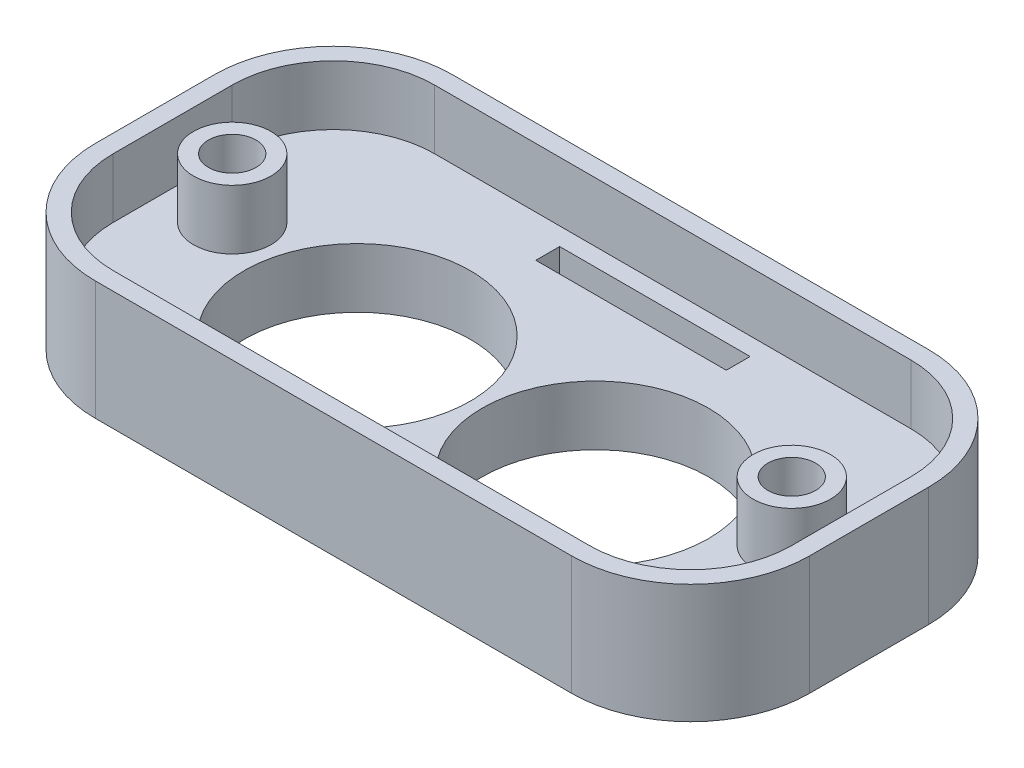
ISO-10303-21;
HEADER;
FILE_DESCRIPTION(('STEP AP214'),'2;1');
FILE_NAME('part.step','',(''),(''),'','','');
FILE_SCHEMA(('AUTOMOTIVE_DESIGN { 1 0 10303 214 1 1 1 1 }'));
ENDSEC;
DATA;
#1=APPLICATION_CONTEXT('core data for automotive mechanical design processes');
#2=APPLICATION_PROTOCOL_DEFINITION('international standard','automotive_design',2000,#1);
#3=PRODUCT_CONTEXT('',#1,'mechanical');
#4=PRODUCT('Part','Part','',(#3));
#5=PRODUCT_RELATED_PRODUCT_CATEGORY('part','',(#4));
#6=PRODUCT_DEFINITION_FORMATION('','',#4);
#7=PRODUCT_DEFINITION_CONTEXT('part definition',#1,'design');
#8=PRODUCT_DEFINITION('design','',#6,#7);
#9=PRODUCT_DEFINITION_SHAPE('','',#8);
#10=(LENGTH_UNIT() NAMED_UNIT(*) SI_UNIT(.MILLI.,.METRE.));
#11=(NAMED_UNIT(*) PLANE_ANGLE_UNIT() SI_UNIT($,.RADIAN.));
#12=(NAMED_UNIT(*) SI_UNIT($,.STERADIAN.) SOLID_ANGLE_UNIT());
#13=UNCERTAINTY_MEASURE_WITH_UNIT(LENGTH_MEASURE(1.E-05),#10,'distance_accuracy_value','');
#14=(GEOMETRIC_REPRESENTATION_CONTEXT(3) GLOBAL_UNCERTAINTY_ASSIGNED_CONTEXT((#13)) GLOBAL_UNIT_ASSIGNED_CONTEXT((#10,
#11,#12)) REPRESENTATION_CONTEXT('',''));
#15=CARTESIAN_POINT('',(0.,0.,0.));
#16=DIRECTION('',(0.,0.,1.));
#17=DIRECTION('',(1.,0.,0.));
#18=AXIS2_PLACEMENT_3D('',#15,#16,#17);
#19=CARTESIAN_POINT('',(20.,10.,-8.));
#20=DIRECTION('',(0.,-1.,0.));
#21=DIRECTION('',(0.,0.,-1.));
#22=AXIS2_PLACEMENT_3D('',#19,#20,#21);
#23=PLANE('',#22);
#24=CARTESIAN_POINT('',(20.,10.,-8.));
#25=DIRECTION('',(0.,1.,0.));
#26=DIRECTION('',(0.,0.,-1.));
#27=AXIS2_PLACEMENT_3D('',#24,#25,#26);
#28=CIRCLE('',#27,10.);
#29=CARTESIAN_POINT('',(30.,10.,-8.));
#30=VERTEX_POINT('',#29);
#31=CARTESIAN_POINT('',(20.,10.,-18.));
#32=VERTEX_POINT('',#31);
#33=EDGE_CURVE('E299',#30,#32,#28,.T.);
#34=ORIENTED_EDGE('',*,*,#33,.T.);
#35=DIRECTION('',(-1.,0.,0.));
#36=VECTOR('',#35,1.);
#37=CARTESIAN_POINT('',(-20.,10.,-18.));
#38=LINE('',#37,#36);
#39=CARTESIAN_POINT('',(-20.,10.,-18.));
#40=VERTEX_POINT('',#39);
#41=EDGE_CURVE('E302',#32,#40,#38,.T.);
#42=ORIENTED_EDGE('',*,*,#41,.T.);
#43=CARTESIAN_POINT('',(-20.,10.,-8.));
#44=DIRECTION('',(0.,1.,0.));
#45=DIRECTION('',(0.,0.,1.));
#46=AXIS2_PLACEMENT_3D('',#43,#44,#45);
#47=CIRCLE('',#46,10.);
#48=CARTESIAN_POINT('',(-30.,10.,-8.));
#49=VERTEX_POINT('',#48);
#50=EDGE_CURVE('E305',#40,#49,#47,.T.);
#51=ORIENTED_EDGE('',*,*,#50,.T.);
#52=DIRECTION('',(0.,0.,1.));
#53=VECTOR('',#52,1.);
#54=CARTESIAN_POINT('',(-30.,10.,-8.));
#55=LINE('',#54,#53);
#56=CARTESIAN_POINT('',(-30.,10.,2.));
#57=VERTEX_POINT('',#56);
#58=EDGE_CURVE('E307',#49,#57,#55,.T.);
#59=ORIENTED_EDGE('',*,*,#58,.T.);
#60=CARTESIAN_POINT('',(-20.,10.,2.));
#61=DIRECTION('',(0.,1.,0.));
#62=DIRECTION('',(0.,0.,1.));
#63=AXIS2_PLACEMENT_3D('',#60,#61,#62);
#64=CIRCLE('',#63,10.);
#65=CARTESIAN_POINT('',(-20.,10.,12.));
#66=VERTEX_POINT('',#65);
#67=EDGE_CURVE('E309',#57,#66,#64,.T.);
#68=ORIENTED_EDGE('',*,*,#67,.T.);
#69=DIRECTION('',(1.,0.,0.));
#70=VECTOR('',#69,1.);
#71=CARTESIAN_POINT('',(-20.,10.,12.));
#72=LINE('',#71,#70);
#73=CARTESIAN_POINT('',(20.,10.,12.));
#74=VERTEX_POINT('',#73);
#75=EDGE_CURVE('E311',#66,#74,#72,.T.);
#76=ORIENTED_EDGE('',*,*,#75,.T.);
#77=CARTESIAN_POINT('',(20.,10.,2.));
#78=DIRECTION('',(0.,1.,0.));
#79=DIRECTION('',(0.,0.,1.));
#80=AXIS2_PLACEMENT_3D('',#77,#78,#79);
#81=CIRCLE('',#80,10.);
#82=CARTESIAN_POINT('',(30.,10.,2.));
#83=VERTEX_POINT('',#82);
#84=EDGE_CURVE('E313',#74,#83,#81,.T.);
#85=ORIENTED_EDGE('',*,*,#84,.T.);
#86=DIRECTION('',(0.,0.,-1.));
#87=VECTOR('',#86,1.);
#88=CARTESIAN_POINT('',(30.,10.,-8.));
#89=LINE('',#88,#87);
#90=EDGE_CURVE('E315',#83,#30,#89,.T.);
#91=ORIENTED_EDGE('',*,*,#90,.T.);
#92=EDGE_LOOP('',(#34,#42,#51,#59,#68,#76,#85,#91));
#93=FACE_BOUND('',#92,.T.);
#94=CARTESIAN_POINT('',(20.,10.,2.));
#95=DIRECTION('',(0.,1.,0.));
#96=DIRECTION('',(0.,0.,1.));
#97=AXIS2_PLACEMENT_3D('',#94,#95,#96);
#98=CIRCLE('',#97,8.50000000000001);
#99=CARTESIAN_POINT('',(28.5,10.,1.99999999999999));
#100=VERTEX_POINT('',#99);
#101=CARTESIAN_POINT('',(20.,10.,10.5));
#102=VERTEX_POINT('',#101);
#103=EDGE_CURVE('E223',#100,#102,#98,.F.);
#104=ORIENTED_EDGE('',*,*,#103,.T.);
#105=DIRECTION('',(1.,0.,0.));
#106=VECTOR('',#105,1.);
#107=CARTESIAN_POINT('',(0.,10.,10.5));
#108=LINE('',#107,#106);
#109=CARTESIAN_POINT('',(-20.,10.,10.5));
#110=VERTEX_POINT('',#109);
#111=EDGE_CURVE('E229',#110,#102,#108,.T.);
#112=ORIENTED_EDGE('',*,*,#111,.F.);
#113=CARTESIAN_POINT('',(-20.,10.,2.));
#114=DIRECTION('',(0.,1.,0.));
#115=DIRECTION('',(0.,0.,1.));
#116=AXIS2_PLACEMENT_3D('',#113,#114,#115);
#117=CIRCLE('',#116,8.5);
#118=CARTESIAN_POINT('',(-28.5,10.,2.));
#119=VERTEX_POINT('',#118);
#120=EDGE_CURVE('E271',#119,#110,#117,.T.);
#121=ORIENTED_EDGE('',*,*,#120,.F.);
#122=DIRECTION('',(0.,0.,1.));
#123=VECTOR('',#122,1.);
#124=CARTESIAN_POINT('',(-28.5,10.,0.));
#125=LINE('',#124,#123);
#126=CARTESIAN_POINT('',(-28.5,10.,-8.));
#127=VERTEX_POINT('',#126);
#128=EDGE_CURVE('E268',#127,#119,#125,.T.);
#129=ORIENTED_EDGE('',*,*,#128,.F.);
#130=CARTESIAN_POINT('',(-20.,10.,-8.));
#131=DIRECTION('',(0.,1.,0.));
#132=DIRECTION('',(0.,0.,1.));
#133=AXIS2_PLACEMENT_3D('',#130,#131,#132);
#134=CIRCLE('',#133,8.5);
#135=CARTESIAN_POINT('',(-20.,10.,-16.5));
#136=VERTEX_POINT('',#135);
#137=EDGE_CURVE('E265',#136,#127,#134,.T.);
#138=ORIENTED_EDGE('',*,*,#137,.F.);
#139=DIRECTION('',(1.,0.,0.));
#140=VECTOR('',#139,1.);
#141=CARTESIAN_POINT('',(0.,10.,-16.5));
#142=LINE('',#141,#140);
#143=CARTESIAN_POINT('',(20.,10.,-16.5));
#144=VERTEX_POINT('',#143);
#145=EDGE_CURVE('E262',#136,#144,#142,.T.);
#146=ORIENTED_EDGE('',*,*,#145,.T.);
#147=CARTESIAN_POINT('',(20.,10.,-8.));
#148=DIRECTION('',(0.,1.,0.));
#149=DIRECTION('',(0.,0.,1.));
#150=AXIS2_PLACEMENT_3D('',#147,#148,#149);
#151=CIRCLE('',#150,8.50000000000001);
#152=CARTESIAN_POINT('',(28.5,10.,-8.00000000000001));
#153=VERTEX_POINT('',#152);
#154=EDGE_CURVE('E259',#144,#153,#151,.F.);
#155=ORIENTED_EDGE('',*,*,#154,.T.);
#156=DIRECTION('',(0.,0.,1.));
#157=VECTOR('',#156,1.);
#158=CARTESIAN_POINT('',(28.5,10.,0.));
#159=LINE('',#158,#157);
#160=EDGE_CURVE('E256',#153,#100,#159,.T.);
#161=ORIENTED_EDGE('',*,*,#160,.T.);
#162=EDGE_LOOP('',(#104,#112,#121,#129,#138,#146,#155,#161));
#163=FACE_BOUND('',#162,.T.);
#164=ADVANCED_FACE('F34',(#93,#163),#23,.F.);
#165=CARTESIAN_POINT('',(-9.99999999999999,10.,0.));
#166=DIRECTION('',(0.,-1.,0.));
#167=DIRECTION('',(0.,0.,-1.));
#168=AXIS2_PLACEMENT_3D('',#165,#166,#167);
#169=CYLINDRICAL_SURFACE('',#168,9.5);
#170=CARTESIAN_POINT('',(-9.99999999999999,0.,0.));
#171=DIRECTION('',(0.,1.,0.));
#172=DIRECTION('',(0.,0.,1.));
#173=AXIS2_PLACEMENT_3D('',#170,#171,#172);
#174=CIRCLE('',#173,9.5);
#175=CARTESIAN_POINT('',(-9.99999999999999,0.,9.5));
#176=VERTEX_POINT('',#175);
#177=EDGE_CURVE('E295',#176,#176,#174,.T.);
#178=ORIENTED_EDGE('',*,*,#177,.F.);
#179=EDGE_LOOP('',(#178));
#180=FACE_BOUND('',#179,.T.);
#181=CARTESIAN_POINT('',(-9.99999999999999,5.,0.));
#182=DIRECTION('',(0.,1.,0.));
#183=DIRECTION('',(0.,0.,1.));
#184=AXIS2_PLACEMENT_3D('',#181,#182,#183);
#185=CIRCLE('',#184,9.5);
#186=CARTESIAN_POINT('',(-9.99999999999999,5.,9.5));
#187=VERTEX_POINT('',#186);
#188=EDGE_CURVE('E250',#187,#187,#185,.F.);
#189=ORIENTED_EDGE('',*,*,#188,.F.);
#190=EDGE_LOOP('',(#189));
#191=FACE_BOUND('',#190,.T.);
#192=ADVANCED_FACE('F386',(#180,#191),#169,.F.);
#193=CARTESIAN_POINT('',(9.99999999999999,10.,0.));
#194=DIRECTION('',(0.,-1.,0.));
#195=DIRECTION('',(0.,0.,-1.));
#196=AXIS2_PLACEMENT_3D('',#193,#194,#195);
#197=CYLINDRICAL_SURFACE('',#196,9.5);
#198=CARTESIAN_POINT('',(9.99999999999999,0.,0.));
#199=DIRECTION('',(0.,1.,0.));
#200=DIRECTION('',(0.,0.,-1.));
#201=AXIS2_PLACEMENT_3D('',#198,#199,#200);
#202=CIRCLE('',#201,9.5);
#203=CARTESIAN_POINT('',(9.99999999999999,0.,-9.50000000000003));
#204=VERTEX_POINT('',#203);
#205=EDGE_CURVE('E278',#204,#204,#202,.T.);
#206=ORIENTED_EDGE('',*,*,#205,.F.);
#207=EDGE_LOOP('',(#206));
#208=FACE_BOUND('',#207,.T.);
#209=CARTESIAN_POINT('',(9.99999999999999,5.,0.));
#210=DIRECTION('',(0.,1.,0.));
#211=DIRECTION('',(0.,0.,1.));
#212=AXIS2_PLACEMENT_3D('',#209,#210,#211);
#213=CIRCLE('',#212,9.5);
#214=CARTESIAN_POINT('',(9.99999999999999,5.,9.49999999999997));
#215=VERTEX_POINT('',#214);
#216=EDGE_CURVE('E247',#215,#215,#213,.F.);
#217=ORIENTED_EDGE('',*,*,#216,.F.);
#218=EDGE_LOOP('',(#217));
#219=FACE_BOUND('',#218,.T.);
#220=ADVANCED_FACE('F392',(#208,#219),#197,.F.);
#221=CARTESIAN_POINT('',(20.,0.,-8.));
#222=DIRECTION('',(0.,-1.,0.));
#223=DIRECTION('',(0.,0.,-1.));
#224=AXIS2_PLACEMENT_3D('',#221,#222,#223);
#225=PLANE('',#224);
#226=DIRECTION('',(0.,0.,1.));
#227=VECTOR('',#226,1.);
#228=CARTESIAN_POINT('',(-8.,0.,-15.));
#229=LINE('',#228,#227);
#230=CARTESIAN_POINT('',(-8.,0.,-15.));
#231=VERTEX_POINT('',#230);
#232=CARTESIAN_POINT('',(-8.,0.,-13.));
#233=VERTEX_POINT('',#232);
#234=EDGE_CURVE('E173',#231,#233,#229,.T.);
#235=ORIENTED_EDGE('',*,*,#234,.T.);
#236=DIRECTION('',(1.,0.,0.));
#237=VECTOR('',#236,1.);
#238=CARTESIAN_POINT('',(-8.,0.,-13.));
#239=LINE('',#238,#237);
#240=CARTESIAN_POINT('',(8.,0.,-13.));
#241=VERTEX_POINT('',#240);
#242=EDGE_CURVE('E182',#233,#241,#239,.T.);
#243=ORIENTED_EDGE('',*,*,#242,.T.);
#244=DIRECTION('',(0.,0.,-1.));
#245=VECTOR('',#244,1.);
#246=CARTESIAN_POINT('',(8.,0.,-15.));
#247=LINE('',#246,#245);
#248=CARTESIAN_POINT('',(8.,0.,-15.));
#249=VERTEX_POINT('',#248);
#250=EDGE_CURVE('E49',#241,#249,#247,.T.);
#251=ORIENTED_EDGE('',*,*,#250,.T.);
#252=DIRECTION('',(-1.,0.,0.));
#253=VECTOR('',#252,1.);
#254=CARTESIAN_POINT('',(-8.,0.,-15.));
#255=LINE('',#254,#253);
#256=EDGE_CURVE('E179',#249,#231,#255,.T.);
#257=ORIENTED_EDGE('',*,*,#256,.T.);
#258=EDGE_LOOP('',(#235,#243,#251,#257));
#259=FACE_BOUND('',#258,.T.);
#260=ORIENTED_EDGE('',*,*,#177,.T.);
#261=EDGE_LOOP('',(#260));
#262=FACE_BOUND('',#261,.T.);
#263=CARTESIAN_POINT('',(20.,0.,-8.));
#264=DIRECTION('',(0.,1.,0.));
#265=DIRECTION('',(0.,0.,-1.));
#266=AXIS2_PLACEMENT_3D('',#263,#264,#265);
#267=CIRCLE('',#266,10.);
#268=CARTESIAN_POINT('',(30.,0.,-8.));
#269=VERTEX_POINT('',#268);
#270=CARTESIAN_POINT('',(20.,0.,-18.));
#271=VERTEX_POINT('',#270);
#272=EDGE_CURVE('E298',#269,#271,#267,.T.);
#273=ORIENTED_EDGE('',*,*,#272,.F.);
#274=DIRECTION('',(0.,0.,-1.));
#275=VECTOR('',#274,1.);
#276=CARTESIAN_POINT('',(30.,0.,-8.));
#277=LINE('',#276,#275);
#278=CARTESIAN_POINT('',(30.,0.,2.));
#279=VERTEX_POINT('',#278);
#280=EDGE_CURVE('E303',#279,#269,#277,.T.);
#281=ORIENTED_EDGE('',*,*,#280,.F.);
#282=CARTESIAN_POINT('',(20.,0.,2.));
#283=DIRECTION('',(0.,1.,0.));
#284=DIRECTION('',(0.,0.,1.));
#285=AXIS2_PLACEMENT_3D('',#282,#283,#284);
#286=CIRCLE('',#285,10.);
#287=CARTESIAN_POINT('',(20.,0.,12.));
#288=VERTEX_POINT('',#287);
#289=EDGE_CURVE('E330',#288,#279,#286,.T.);
#290=ORIENTED_EDGE('',*,*,#289,.F.);
#291=DIRECTION('',(1.,0.,0.));
#292=VECTOR('',#291,1.);
#293=CARTESIAN_POINT('',(-20.,0.,12.));
#294=LINE('',#293,#292);
#295=CARTESIAN_POINT('',(-20.,0.,12.));
#296=VERTEX_POINT('',#295);
#297=EDGE_CURVE('E328',#296,#288,#294,.T.);
#298=ORIENTED_EDGE('',*,*,#297,.F.);
#299=CARTESIAN_POINT('',(-20.,0.,2.));
#300=DIRECTION('',(0.,1.,0.));
#301=DIRECTION('',(0.,0.,1.));
#302=AXIS2_PLACEMENT_3D('',#299,#300,#301);
#303=CIRCLE('',#302,10.);
#304=CARTESIAN_POINT('',(-30.,0.,2.));
#305=VERTEX_POINT('',#304);
#306=EDGE_CURVE('E326',#305,#296,#303,.T.);
#307=ORIENTED_EDGE('',*,*,#306,.F.);
#308=DIRECTION('',(0.,0.,1.));
#309=VECTOR('',#308,1.);
#310=CARTESIAN_POINT('',(-30.,0.,-8.));
#311=LINE('',#310,#309);
#312=CARTESIAN_POINT('',(-30.,0.,-8.));
#313=VERTEX_POINT('',#312);
#314=EDGE_CURVE('E324',#313,#305,#311,.T.);
#315=ORIENTED_EDGE('',*,*,#314,.F.);
#316=CARTESIAN_POINT('',(-20.,0.,-8.));
#317=DIRECTION('',(0.,1.,0.));
#318=DIRECTION('',(0.,0.,1.));
#319=AXIS2_PLACEMENT_3D('',#316,#317,#318);
#320=CIRCLE('',#319,10.);
#321=CARTESIAN_POINT('',(-20.,0.,-18.));
#322=VERTEX_POINT('',#321);
#323=EDGE_CURVE('E322',#322,#313,#320,.T.);
#324=ORIENTED_EDGE('',*,*,#323,.F.);
#325=DIRECTION('',(-1.,0.,0.));
#326=VECTOR('',#325,1.);
#327=CARTESIAN_POINT('',(-20.,0.,-18.));
#328=LINE('',#327,#326);
#329=EDGE_CURVE('E320',#271,#322,#328,.T.);
#330=ORIENTED_EDGE('',*,*,#329,.F.);
#331=EDGE_LOOP('',(#273,#281,#290,#298,#307,#315,#324,#330));
#332=FACE_BOUND('',#331,.T.);
#333=ORIENTED_EDGE('',*,*,#205,.T.);
#334=EDGE_LOOP('',(#333));
#335=FACE_BOUND('',#334,.T.);
#336=ADVANCED_FACE('F186',(#259,#262,#332,#335),#225,.T.);
#337=CARTESIAN_POINT('',(20.,10.,-8.));
#338=DIRECTION('',(0.,-1.,0.));
#339=DIRECTION('',(0.,0.,-1.));
#340=AXIS2_PLACEMENT_3D('',#337,#338,#339);
#341=CYLINDRICAL_SURFACE('',#340,10.);
#342=ORIENTED_EDGE('',*,*,#272,.T.);
#343=DIRECTION('',(0.,-1.,0.));
#344=VECTOR('',#343,1.);
#345=CARTESIAN_POINT('',(20.,10.,-18.));
#346=LINE('',#345,#344);
#347=EDGE_CURVE('E353',#32,#271,#346,.T.);
#348=ORIENTED_EDGE('',*,*,#347,.F.);
#349=ORIENTED_EDGE('',*,*,#33,.F.);
#350=DIRECTION('',(0.,-1.,0.));
#351=VECTOR('',#350,1.);
#352=CARTESIAN_POINT('',(30.,10.,-8.));
#353=LINE('',#352,#351);
#354=EDGE_CURVE('E317',#30,#269,#353,.T.);
#355=ORIENTED_EDGE('',*,*,#354,.T.);
#356=EDGE_LOOP('',(#342,#348,#349,#355));
#357=FACE_BOUND('',#356,.T.);
#358=ADVANCED_FACE('F36',(#357),#341,.T.);
#359=CARTESIAN_POINT('',(-20.,10.,-18.));
#360=DIRECTION('',(0.,0.,1.));
#361=DIRECTION('',(1.,0.,0.));
#362=AXIS2_PLACEMENT_3D('',#359,#360,#361);
#363=PLANE('',#362);
#364=ORIENTED_EDGE('',*,*,#329,.T.);
#365=DIRECTION('',(0.,-1.,0.));
#366=VECTOR('',#365,1.);
#367=CARTESIAN_POINT('',(-20.,10.,-18.));
#368=LINE('',#367,#366);
#369=EDGE_CURVE('E350',#40,#322,#368,.T.);
#370=ORIENTED_EDGE('',*,*,#369,.F.);
#371=ORIENTED_EDGE('',*,*,#41,.F.);
#372=ORIENTED_EDGE('',*,*,#347,.T.);
#373=EDGE_LOOP('',(#364,#370,#371,#372));
#374=FACE_BOUND('',#373,.T.);
#375=ADVANCED_FACE('F423',(#374),#363,.F.);
#376=CARTESIAN_POINT('',(-20.,10.,-8.));
#377=DIRECTION('',(0.,-1.,0.));
#378=DIRECTION('',(0.,0.,-1.));
#379=AXIS2_PLACEMENT_3D('',#376,#377,#378);
#380=CYLINDRICAL_SURFACE('',#379,10.);
#381=ORIENTED_EDGE('',*,*,#323,.T.);
#382=DIRECTION('',(0.,-1.,0.));
#383=VECTOR('',#382,1.);
#384=CARTESIAN_POINT('',(-30.,10.,-8.));
#385=LINE('',#384,#383);
#386=EDGE_CURVE('E347',#49,#313,#385,.T.);
#387=ORIENTED_EDGE('',*,*,#386,.F.);
#388=ORIENTED_EDGE('',*,*,#50,.F.);
#389=ORIENTED_EDGE('',*,*,#369,.T.);
#390=EDGE_LOOP('',(#381,#387,#388,#389));
#391=FACE_BOUND('',#390,.T.);
#392=ADVANCED_FACE('F420',(#391),#380,.T.);
#393=CARTESIAN_POINT('',(-30.,10.,-8.));
#394=DIRECTION('',(1.,0.,0.));
#395=DIRECTION('',(0.,0.,-1.));
#396=AXIS2_PLACEMENT_3D('',#393,#394,#395);
#397=PLANE('',#396);
#398=ORIENTED_EDGE('',*,*,#314,.T.);
#399=DIRECTION('',(0.,-1.,0.));
#400=VECTOR('',#399,1.);
#401=CARTESIAN_POINT('',(-30.,10.,2.));
#402=LINE('',#401,#400);
#403=EDGE_CURVE('E344',#57,#305,#402,.T.);
#404=ORIENTED_EDGE('',*,*,#403,.F.);
#405=ORIENTED_EDGE('',*,*,#58,.F.);
#406=ORIENTED_EDGE('',*,*,#386,.T.);
#407=EDGE_LOOP('',(#398,#404,#405,#406));
#408=FACE_BOUND('',#407,.T.);
#409=ADVANCED_FACE('F416',(#408),#397,.F.);
#410=CARTESIAN_POINT('',(-20.,10.,2.));
#411=DIRECTION('',(0.,-1.,0.));
#412=DIRECTION('',(0.,0.,-1.));
#413=AXIS2_PLACEMENT_3D('',#410,#411,#412);
#414=CYLINDRICAL_SURFACE('',#413,10.);
#415=ORIENTED_EDGE('',*,*,#306,.T.);
#416=DIRECTION('',(0.,-1.,0.));
#417=VECTOR('',#416,1.);
#418=CARTESIAN_POINT('',(-20.,10.,12.));
#419=LINE('',#418,#417);
#420=EDGE_CURVE('E341',#66,#296,#419,.T.);
#421=ORIENTED_EDGE('',*,*,#420,.F.);
#422=ORIENTED_EDGE('',*,*,#67,.F.);
#423=ORIENTED_EDGE('',*,*,#403,.T.);
#424=EDGE_LOOP('',(#415,#421,#422,#423));
#425=FACE_BOUND('',#424,.T.);
#426=ADVANCED_FACE('F412',(#425),#414,.T.);
#427=CARTESIAN_POINT('',(-20.,10.,12.));
#428=DIRECTION('',(0.,0.,-1.));
#429=DIRECTION('',(-1.,0.,0.));
#430=AXIS2_PLACEMENT_3D('',#427,#428,#429);
#431=PLANE('',#430);
#432=ORIENTED_EDGE('',*,*,#297,.T.);
#433=DIRECTION('',(0.,-1.,0.));
#434=VECTOR('',#433,1.);
#435=CARTESIAN_POINT('',(20.,10.,12.));
#436=LINE('',#435,#434);
#437=EDGE_CURVE('E338',#74,#288,#436,.T.);
#438=ORIENTED_EDGE('',*,*,#437,.F.);
#439=ORIENTED_EDGE('',*,*,#75,.F.);
#440=ORIENTED_EDGE('',*,*,#420,.T.);
#441=EDGE_LOOP('',(#432,#438,#439,#440));
#442=FACE_BOUND('',#441,.T.);
#443=ADVANCED_FACE('F408',(#442),#431,.F.);
#444=CARTESIAN_POINT('',(20.,10.,2.));
#445=DIRECTION('',(0.,-1.,0.));
#446=DIRECTION('',(0.,0.,-1.));
#447=AXIS2_PLACEMENT_3D('',#444,#445,#446);
#448=CYLINDRICAL_SURFACE('',#447,10.);
#449=ORIENTED_EDGE('',*,*,#289,.T.);
#450=DIRECTION('',(0.,-1.,0.));
#451=VECTOR('',#450,1.);
#452=CARTESIAN_POINT('',(30.,10.,2.));
#453=LINE('',#452,#451);
#454=EDGE_CURVE('E335',#83,#279,#453,.T.);
#455=ORIENTED_EDGE('',*,*,#454,.F.);
#456=ORIENTED_EDGE('',*,*,#84,.F.);
#457=ORIENTED_EDGE('',*,*,#437,.T.);
#458=EDGE_LOOP('',(#449,#455,#456,#457));
#459=FACE_BOUND('',#458,.T.);
#460=ADVANCED_FACE('F404',(#459),#448,.T.);
#461=CARTESIAN_POINT('',(30.,10.,-8.));
#462=DIRECTION('',(-1.,0.,0.));
#463=DIRECTION('',(0.,0.,1.));
#464=AXIS2_PLACEMENT_3D('',#461,#462,#463);
#465=PLANE('',#464);
#466=ORIENTED_EDGE('',*,*,#280,.T.);
#467=ORIENTED_EDGE('',*,*,#354,.F.);
#468=ORIENTED_EDGE('',*,*,#90,.F.);
#469=ORIENTED_EDGE('',*,*,#454,.T.);
#470=EDGE_LOOP('',(#466,#467,#468,#469));
#471=FACE_BOUND('',#470,.T.);
#472=ADVANCED_FACE('F400',(#471),#465,.F.);
#473=CARTESIAN_POINT('',(20.,5.,2.));
#474=DIRECTION('',(0.,1.,0.));
#475=DIRECTION('',(0.,0.,1.));
#476=AXIS2_PLACEMENT_3D('',#473,#474,#475);
#477=CYLINDRICAL_SURFACE('',#476,8.50000000000001);
#478=ORIENTED_EDGE('',*,*,#103,.F.);
#479=DIRECTION('',(0.,1.,0.));
#480=VECTOR('',#479,1.);
#481=CARTESIAN_POINT('',(28.5,5.,1.99999999999999));
#482=LINE('',#481,#480);
#483=CARTESIAN_POINT('',(28.5,5.,1.99999999999999));
#484=VERTEX_POINT('',#483);
#485=EDGE_CURVE('E253',#484,#100,#482,.T.);
#486=ORIENTED_EDGE('',*,*,#485,.F.);
#487=CARTESIAN_POINT('',(20.,5.,2.));
#488=DIRECTION('',(0.,1.,0.));
#489=DIRECTION('',(0.,0.,1.));
#490=AXIS2_PLACEMENT_3D('',#487,#488,#489);
#491=CIRCLE('',#490,8.50000000000001);
#492=CARTESIAN_POINT('',(20.,5.,10.5));
#493=VERTEX_POINT('',#492);
#494=EDGE_CURVE('E226',#484,#493,#491,.F.);
#495=ORIENTED_EDGE('',*,*,#494,.T.);
#496=DIRECTION('',(0.,1.,0.));
#497=VECTOR('',#496,1.);
#498=CARTESIAN_POINT('',(20.,5.,10.5));
#499=LINE('',#498,#497);
#500=EDGE_CURVE('E276',#493,#102,#499,.T.);
#501=ORIENTED_EDGE('',*,*,#500,.T.);
#502=EDGE_LOOP('',(#478,#486,#495,#501));
#503=FACE_BOUND('',#502,.T.);
#504=ADVANCED_FACE('F403',(#503),#477,.F.);
#505=CARTESIAN_POINT('',(0.,5.,10.5));
#506=DIRECTION('',(0.,0.,1.));
#507=DIRECTION('',(1.,0.,0.));
#508=AXIS2_PLACEMENT_3D('',#505,#506,#507);
#509=PLANE('',#508);
#510=ORIENTED_EDGE('',*,*,#111,.T.);
#511=ORIENTED_EDGE('',*,*,#500,.F.);
#512=DIRECTION('',(1.,0.,0.));
#513=VECTOR('',#512,1.);
#514=CARTESIAN_POINT('',(0.,5.,10.5));
#515=LINE('',#514,#513);
#516=CARTESIAN_POINT('',(-20.,5.,10.5));
#517=VERTEX_POINT('',#516);
#518=EDGE_CURVE('E244',#517,#493,#515,.T.);
#519=ORIENTED_EDGE('',*,*,#518,.F.);
#520=DIRECTION('',(0.,1.,0.));
#521=VECTOR('',#520,1.);
#522=CARTESIAN_POINT('',(-20.,5.,10.5));
#523=LINE('',#522,#521);
#524=EDGE_CURVE('E279',#517,#110,#523,.T.);
#525=ORIENTED_EDGE('',*,*,#524,.T.);
#526=EDGE_LOOP('',(#510,#511,#519,#525));
#527=FACE_BOUND('',#526,.T.);
#528=ADVANCED_FACE('F469',(#527),#509,.F.);
#529=CARTESIAN_POINT('',(-20.,5.,2.));
#530=DIRECTION('',(0.,1.,0.));
#531=DIRECTION('',(0.,0.,1.));
#532=AXIS2_PLACEMENT_3D('',#529,#530,#531);
#533=CYLINDRICAL_SURFACE('',#532,8.5);
#534=ORIENTED_EDGE('',*,*,#120,.T.);
#535=ORIENTED_EDGE('',*,*,#524,.F.);
#536=CARTESIAN_POINT('',(-20.,5.,2.));
#537=DIRECTION('',(0.,1.,0.));
#538=DIRECTION('',(0.,0.,1.));
#539=AXIS2_PLACEMENT_3D('',#536,#537,#538);
#540=CIRCLE('',#539,8.5);
#541=CARTESIAN_POINT('',(-28.5,5.,2.));
#542=VERTEX_POINT('',#541);
#543=EDGE_CURVE('E241',#542,#517,#540,.T.);
#544=ORIENTED_EDGE('',*,*,#543,.F.);
#545=DIRECTION('',(0.,1.,0.));
#546=VECTOR('',#545,1.);
#547=CARTESIAN_POINT('',(-28.5,5.,2.));
#548=LINE('',#547,#546);
#549=EDGE_CURVE('E281',#542,#119,#548,.T.);
#550=ORIENTED_EDGE('',*,*,#549,.T.);
#551=EDGE_LOOP('',(#534,#535,#544,#550));
#552=FACE_BOUND('',#551,.T.);
#553=ADVANCED_FACE('F489',(#552),#533,.F.);
#554=CARTESIAN_POINT('',(-28.5,5.,0.));
#555=DIRECTION('',(-1.,0.,0.));
#556=DIRECTION('',(0.,0.,1.));
#557=AXIS2_PLACEMENT_3D('',#554,#555,#556);
#558=PLANE('',#557);
#559=ORIENTED_EDGE('',*,*,#128,.T.);
#560=ORIENTED_EDGE('',*,*,#549,.F.);
#561=DIRECTION('',(0.,0.,1.));
#562=VECTOR('',#561,1.);
#563=CARTESIAN_POINT('',(-28.5,5.,0.));
#564=LINE('',#563,#562);
#565=CARTESIAN_POINT('',(-28.5,5.,-8.));
#566=VERTEX_POINT('',#565);
#567=EDGE_CURVE('E238',#566,#542,#564,.T.);
#568=ORIENTED_EDGE('',*,*,#567,.F.);
#569=DIRECTION('',(0.,1.,0.));
#570=VECTOR('',#569,1.);
#571=CARTESIAN_POINT('',(-28.5,5.,-8.));
#572=LINE('',#571,#570);
#573=EDGE_CURVE('E283',#566,#127,#572,.T.);
#574=ORIENTED_EDGE('',*,*,#573,.T.);
#575=EDGE_LOOP('',(#559,#560,#568,#574));
#576=FACE_BOUND('',#575,.T.);
#577=ADVANCED_FACE('F485',(#576),#558,.F.);
#578=CARTESIAN_POINT('',(-20.,5.,-8.));
#579=DIRECTION('',(0.,1.,0.));
#580=DIRECTION('',(0.,0.,1.));
#581=AXIS2_PLACEMENT_3D('',#578,#579,#580);
#582=CYLINDRICAL_SURFACE('',#581,8.5);
#583=ORIENTED_EDGE('',*,*,#137,.T.);
#584=ORIENTED_EDGE('',*,*,#573,.F.);
#585=CARTESIAN_POINT('',(-20.,5.,-8.));
#586=DIRECTION('',(0.,1.,0.));
#587=DIRECTION('',(0.,0.,1.));
#588=AXIS2_PLACEMENT_3D('',#585,#586,#587);
#589=CIRCLE('',#588,8.5);
#590=CARTESIAN_POINT('',(-20.,5.,-16.5));
#591=VERTEX_POINT('',#590);
#592=EDGE_CURVE('E235',#591,#566,#589,.T.);
#593=ORIENTED_EDGE('',*,*,#592,.F.);
#594=DIRECTION('',(0.,1.,0.));
#595=VECTOR('',#594,1.);
#596=CARTESIAN_POINT('',(-20.,5.,-16.5));
#597=LINE('',#596,#595);
#598=EDGE_CURVE('E285',#591,#136,#597,.T.);
#599=ORIENTED_EDGE('',*,*,#598,.T.);
#600=EDGE_LOOP('',(#583,#584,#593,#599));
#601=FACE_BOUND('',#600,.T.);
#602=ADVANCED_FACE('F481',(#601),#582,.F.);
#603=CARTESIAN_POINT('',(0.,5.,-16.5));
#604=DIRECTION('',(0.,0.,1.));
#605=DIRECTION('',(1.,0.,0.));
#606=AXIS2_PLACEMENT_3D('',#603,#604,#605);
#607=PLANE('',#606);
#608=ORIENTED_EDGE('',*,*,#145,.F.);
#609=ORIENTED_EDGE('',*,*,#598,.F.);
#610=DIRECTION('',(1.,0.,0.));
#611=VECTOR('',#610,1.);
#612=CARTESIAN_POINT('',(0.,5.,-16.5));
#613=LINE('',#612,#611);
#614=CARTESIAN_POINT('',(20.,5.,-16.5));
#615=VERTEX_POINT('',#614);
#616=EDGE_CURVE('E233',#591,#615,#613,.T.);
#617=ORIENTED_EDGE('',*,*,#616,.T.);
#618=DIRECTION('',(0.,1.,0.));
#619=VECTOR('',#618,1.);
#620=CARTESIAN_POINT('',(20.,5.,-16.5));
#621=LINE('',#620,#619);
#622=EDGE_CURVE('E287',#615,#144,#621,.T.);
#623=ORIENTED_EDGE('',*,*,#622,.T.);
#624=EDGE_LOOP('',(#608,#609,#617,#623));
#625=FACE_BOUND('',#624,.T.);
#626=ADVANCED_FACE('F477',(#625),#607,.T.);
#627=CARTESIAN_POINT('',(20.,5.,-8.));
#628=DIRECTION('',(0.,1.,0.));
#629=DIRECTION('',(0.,0.,1.));
#630=AXIS2_PLACEMENT_3D('',#627,#628,#629);
#631=CYLINDRICAL_SURFACE('',#630,8.50000000000001);
#632=ORIENTED_EDGE('',*,*,#154,.F.);
#633=ORIENTED_EDGE('',*,*,#622,.F.);
#634=CARTESIAN_POINT('',(20.,5.,-8.));
#635=DIRECTION('',(0.,1.,0.));
#636=DIRECTION('',(0.,0.,1.));
#637=AXIS2_PLACEMENT_3D('',#634,#635,#636);
#638=CIRCLE('',#637,8.50000000000001);
#639=CARTESIAN_POINT('',(28.5,5.,-8.00000000000001));
#640=VERTEX_POINT('',#639);
#641=EDGE_CURVE('E231',#615,#640,#638,.F.);
#642=ORIENTED_EDGE('',*,*,#641,.T.);
#643=DIRECTION('',(0.,1.,0.));
#644=VECTOR('',#643,1.);
#645=CARTESIAN_POINT('',(28.5,5.,-8.00000000000001));
#646=LINE('',#645,#644);
#647=EDGE_CURVE('E289',#640,#153,#646,.T.);
#648=ORIENTED_EDGE('',*,*,#647,.T.);
#649=EDGE_LOOP('',(#632,#633,#642,#648));
#650=FACE_BOUND('',#649,.T.);
#651=ADVANCED_FACE('F473',(#650),#631,.F.);
#652=CARTESIAN_POINT('',(28.5,5.,0.));
#653=DIRECTION('',(-1.,0.,0.));
#654=DIRECTION('',(0.,0.,1.));
#655=AXIS2_PLACEMENT_3D('',#652,#653,#654);
#656=PLANE('',#655);
#657=ORIENTED_EDGE('',*,*,#160,.F.);
#658=ORIENTED_EDGE('',*,*,#647,.F.);
#659=DIRECTION('',(0.,0.,1.));
#660=VECTOR('',#659,1.);
#661=CARTESIAN_POINT('',(28.5,5.,0.));
#662=LINE('',#661,#660);
#663=EDGE_CURVE('E228',#640,#484,#662,.T.);
#664=ORIENTED_EDGE('',*,*,#663,.T.);
#665=ORIENTED_EDGE('',*,*,#485,.T.);
#666=EDGE_LOOP('',(#657,#658,#664,#665));
#667=FACE_BOUND('',#666,.T.);
#668=ADVANCED_FACE('F380',(#667),#656,.T.);
#669=CARTESIAN_POINT('',(0.,5.,0.));
#670=DIRECTION('',(0.,1.,0.));
#671=DIRECTION('',(0.,0.,1.));
#672=AXIS2_PLACEMENT_3D('',#669,#670,#671);
#673=PLANE('',#672);
#674=DIRECTION('',(0.,0.,1.));
#675=VECTOR('',#674,1.);
#676=CARTESIAN_POINT('',(-8.,5.,-15.));
#677=LINE('',#676,#675);
#678=CARTESIAN_POINT('',(-8.,5.,-15.));
#679=VERTEX_POINT('',#678);
#680=CARTESIAN_POINT('',(-8.,5.,-13.));
#681=VERTEX_POINT('',#680);
#682=EDGE_CURVE('E57',#679,#681,#677,.T.);
#683=ORIENTED_EDGE('',*,*,#682,.F.);
#684=DIRECTION('',(-1.,0.,0.));
#685=VECTOR('',#684,1.);
#686=CARTESIAN_POINT('',(-8.,5.,-15.));
#687=LINE('',#686,#685);
#688=CARTESIAN_POINT('',(8.,5.,-15.));
#689=VERTEX_POINT('',#688);
#690=EDGE_CURVE('E189',#689,#679,#687,.T.);
#691=ORIENTED_EDGE('',*,*,#690,.F.);
#692=DIRECTION('',(0.,0.,-1.));
#693=VECTOR('',#692,1.);
#694=CARTESIAN_POINT('',(8.,5.,-15.));
#695=LINE('',#694,#693);
#696=CARTESIAN_POINT('',(8.,5.,-13.));
#697=VERTEX_POINT('',#696);
#698=EDGE_CURVE('E192',#697,#689,#695,.T.);
#699=ORIENTED_EDGE('',*,*,#698,.F.);
#700=DIRECTION('',(1.,0.,0.));
#701=VECTOR('',#700,1.);
#702=CARTESIAN_POINT('',(-8.,5.,-13.));
#703=LINE('',#702,#701);
#704=EDGE_CURVE('E198',#681,#697,#703,.T.);
#705=ORIENTED_EDGE('',*,*,#704,.F.);
#706=EDGE_LOOP('',(#683,#691,#699,#705));
#707=FACE_BOUND('',#706,.T.);
#708=CARTESIAN_POINT('',(23.5,5.,-3.));
#709=DIRECTION('',(0.,1.,0.));
#710=DIRECTION('',(0.,0.,-1.));
#711=AXIS2_PLACEMENT_3D('',#708,#709,#710);
#712=CIRCLE('',#711,3.25);
#713=CARTESIAN_POINT('',(23.5,5.,-6.25000000000001));
#714=VERTEX_POINT('',#713);
#715=EDGE_CURVE('E210',#714,#714,#712,.T.);
#716=ORIENTED_EDGE('',*,*,#715,.F.);
#717=EDGE_LOOP('',(#716));
#718=FACE_BOUND('',#717,.T.);
#719=CARTESIAN_POINT('',(-23.5,5.,-3.));
#720=DIRECTION('',(0.,1.,0.));
#721=DIRECTION('',(0.,0.,1.));
#722=AXIS2_PLACEMENT_3D('',#719,#720,#721);
#723=CIRCLE('',#722,3.25);
#724=CARTESIAN_POINT('',(-23.5,5.,0.250000000000001));
#725=VERTEX_POINT('',#724);
#726=EDGE_CURVE('E219',#725,#725,#723,.T.);
#727=ORIENTED_EDGE('',*,*,#726,.F.);
#728=EDGE_LOOP('',(#727));
#729=FACE_BOUND('',#728,.T.);
#730=ORIENTED_EDGE('',*,*,#494,.F.);
#731=ORIENTED_EDGE('',*,*,#663,.F.);
#732=ORIENTED_EDGE('',*,*,#641,.F.);
#733=ORIENTED_EDGE('',*,*,#616,.F.);
#734=ORIENTED_EDGE('',*,*,#592,.T.);
#735=ORIENTED_EDGE('',*,*,#567,.T.);
#736=ORIENTED_EDGE('',*,*,#543,.T.);
#737=ORIENTED_EDGE('',*,*,#518,.T.);
#738=EDGE_LOOP('',(#730,#731,#732,#733,#734,#735,#736,#737));
#739=FACE_BOUND('',#738,.T.);
#740=ORIENTED_EDGE('',*,*,#216,.T.);
#741=EDGE_LOOP('',(#740));
#742=FACE_BOUND('',#741,.T.);
#743=ORIENTED_EDGE('',*,*,#188,.T.);
#744=EDGE_LOOP('',(#743));
#745=FACE_BOUND('',#744,.T.);
#746=ADVANCED_FACE('F364',(#707,#718,#729,#739,#742,#745),#673,.T.);
#747=CARTESIAN_POINT('',(-23.5,10.,-3.));
#748=DIRECTION('',(0.,1.,0.));
#749=DIRECTION('',(0.,0.,1.));
#750=AXIS2_PLACEMENT_3D('',#747,#748,#749);
#751=PLANE('',#750);
#752=CARTESIAN_POINT('',(-23.5,10.,-3.));
#753=DIRECTION('',(0.,1.,0.));
#754=DIRECTION('',(0.,0.,1.));
#755=AXIS2_PLACEMENT_3D('',#752,#753,#754);
#756=CIRCLE('',#755,3.25);
#757=CARTESIAN_POINT('',(-23.5,10.,0.250000000000001));
#758=VERTEX_POINT('',#757);
#759=EDGE_CURVE('E220',#758,#758,#756,.T.);
#760=ORIENTED_EDGE('',*,*,#759,.T.);
#761=EDGE_LOOP('',(#760));
#762=FACE_BOUND('',#761,.T.);
#763=CARTESIAN_POINT('',(-23.5,10.,-3.));
#764=DIRECTION('',(0.,1.,0.));
#765=DIRECTION('',(0.,0.,1.));
#766=AXIS2_PLACEMENT_3D('',#763,#764,#765);
#767=CIRCLE('',#766,2.);
#768=CARTESIAN_POINT('',(-23.5,10.,-1.));
#769=VERTEX_POINT('',#768);
#770=EDGE_CURVE('E214',#769,#769,#767,.T.);
#771=ORIENTED_EDGE('',*,*,#770,.F.);
#772=EDGE_LOOP('',(#771));
#773=FACE_BOUND('',#772,.T.);
#774=ADVANCED_FACE('F379',(#762,#773),#751,.T.);
#775=CARTESIAN_POINT('',(-23.5,10.,-3.));
#776=DIRECTION('',(0.,-1.,0.));
#777=DIRECTION('',(0.,0.,-1.));
#778=AXIS2_PLACEMENT_3D('',#775,#776,#777);
#779=CYLINDRICAL_SURFACE('',#778,3.25);
#780=ORIENTED_EDGE('',*,*,#759,.F.);
#781=EDGE_LOOP('',(#780));
#782=FACE_BOUND('',#781,.T.);
#783=ORIENTED_EDGE('',*,*,#726,.T.);
#784=EDGE_LOOP('',(#783));
#785=FACE_BOUND('',#784,.T.);
#786=ADVANCED_FACE('F373',(#782,#785),#779,.T.);
#787=CARTESIAN_POINT('',(-23.5,10.,-3.));
#788=DIRECTION('',(0.,-1.,0.));
#789=DIRECTION('',(0.,0.,-1.));
#790=AXIS2_PLACEMENT_3D('',#787,#788,#789);
#791=CYLINDRICAL_SURFACE('',#790,2.);
#792=ORIENTED_EDGE('',*,*,#770,.T.);
#793=EDGE_LOOP('',(#792));
#794=FACE_BOUND('',#793,.T.);
#795=CARTESIAN_POINT('',(-23.5,5.,-3.));
#796=DIRECTION('',(0.,1.,0.));
#797=DIRECTION('',(0.,0.,1.));
#798=AXIS2_PLACEMENT_3D('',#795,#796,#797);
#799=CIRCLE('',#798,2.);
#800=CARTESIAN_POINT('',(-23.5,5.,-1.));
#801=VERTEX_POINT('',#800);
#802=EDGE_CURVE('E42',#801,#801,#799,.F.);
#803=ORIENTED_EDGE('',*,*,#802,.T.);
#804=EDGE_LOOP('',(#803));
#805=FACE_BOUND('',#804,.T.);
#806=ADVANCED_FACE('F358',(#794,#805),#791,.F.);
#807=ORIENTED_EDGE('',*,*,#802,.F.);
#808=EDGE_LOOP('',(#807));
#809=FACE_BOUND('',#808,.T.);
#810=ADVANCED_FACE('F360',(#809),#673,.T.);
#811=CARTESIAN_POINT('',(23.5,10.,-3.));
#812=DIRECTION('',(0.,-1.,0.));
#813=DIRECTION('',(0.,0.,-1.));
#814=AXIS2_PLACEMENT_3D('',#811,#812,#813);
#815=PLANE('',#814);
#816=CARTESIAN_POINT('',(23.5,10.,-3.));
#817=DIRECTION('',(0.,1.,0.));
#818=DIRECTION('',(0.,0.,-1.));
#819=AXIS2_PLACEMENT_3D('',#816,#817,#818);
#820=CIRCLE('',#819,3.25);
#821=CARTESIAN_POINT('',(23.5,10.,-6.25000000000001));
#822=VERTEX_POINT('',#821);
#823=EDGE_CURVE('E211',#822,#822,#820,.T.);
#824=ORIENTED_EDGE('',*,*,#823,.T.);
#825=EDGE_LOOP('',(#824));
#826=FACE_BOUND('',#825,.T.);
#827=CARTESIAN_POINT('',(23.5,10.,-3.));
#828=DIRECTION('',(0.,1.,0.));
#829=DIRECTION('',(0.,0.,-1.));
#830=AXIS2_PLACEMENT_3D('',#827,#828,#829);
#831=CIRCLE('',#830,2.);
#832=CARTESIAN_POINT('',(23.5,10.,-5.));
#833=VERTEX_POINT('',#832);
#834=EDGE_CURVE('E204',#833,#833,#831,.T.);
#835=ORIENTED_EDGE('',*,*,#834,.F.);
#836=EDGE_LOOP('',(#835));
#837=FACE_BOUND('',#836,.T.);
#838=ADVANCED_FACE('F362',(#826,#837),#815,.F.);
#839=CARTESIAN_POINT('',(23.5,10.,-3.));
#840=DIRECTION('',(0.,-1.,0.));
#841=DIRECTION('',(0.,0.,-1.));
#842=AXIS2_PLACEMENT_3D('',#839,#840,#841);
#843=CYLINDRICAL_SURFACE('',#842,3.25);
#844=ORIENTED_EDGE('',*,*,#823,.F.);
#845=EDGE_LOOP('',(#844));
#846=FACE_BOUND('',#845,.T.);
#847=ORIENTED_EDGE('',*,*,#715,.T.);
#848=EDGE_LOOP('',(#847));
#849=FACE_BOUND('',#848,.T.);
#850=ADVANCED_FACE('F370',(#846,#849),#843,.T.);
#851=CARTESIAN_POINT('',(23.5,10.,-3.));
#852=DIRECTION('',(0.,-1.,0.));
#853=DIRECTION('',(0.,0.,-1.));
#854=AXIS2_PLACEMENT_3D('',#851,#852,#853);
#855=CYLINDRICAL_SURFACE('',#854,2.);
#856=ORIENTED_EDGE('',*,*,#834,.T.);
#857=EDGE_LOOP('',(#856));
#858=FACE_BOUND('',#857,.T.);
#859=CARTESIAN_POINT('',(23.5,5.,-3.));
#860=DIRECTION('',(0.,1.,0.));
#861=DIRECTION('',(0.,0.,1.));
#862=AXIS2_PLACEMENT_3D('',#859,#860,#861);
#863=CIRCLE('',#862,2.);
#864=CARTESIAN_POINT('',(23.5,5.,-1.00000000000001));
#865=VERTEX_POINT('',#864);
#866=EDGE_CURVE('E11',#865,#865,#863,.F.);
#867=ORIENTED_EDGE('',*,*,#866,.T.);
#868=EDGE_LOOP('',(#867));
#869=FACE_BOUND('',#868,.T.);
#870=ADVANCED_FACE('F383',(#858,#869),#855,.F.);
#871=ORIENTED_EDGE('',*,*,#866,.F.);
#872=EDGE_LOOP('',(#871));
#873=FACE_BOUND('',#872,.T.);
#874=ADVANCED_FACE('F365',(#873),#673,.T.);
#875=CARTESIAN_POINT('',(-8.,0.,-15.));
#876=DIRECTION('',(-1.,0.,0.));
#877=DIRECTION('',(0.,0.,1.));
#878=AXIS2_PLACEMENT_3D('',#875,#876,#877);
#879=PLANE('',#878);
#880=ORIENTED_EDGE('',*,*,#682,.T.);
#881=DIRECTION('',(0.,1.,0.));
#882=VECTOR('',#881,1.);
#883=CARTESIAN_POINT('',(-8.,0.,-13.));
#884=LINE('',#883,#882);
#885=EDGE_CURVE('E169',#233,#681,#884,.T.);
#886=ORIENTED_EDGE('',*,*,#885,.F.);
#887=ORIENTED_EDGE('',*,*,#234,.F.);
#888=DIRECTION('',(0.,1.,0.));
#889=VECTOR('',#888,1.);
#890=CARTESIAN_POINT('',(-8.,0.,-15.));
#891=LINE('',#890,#889);
#892=EDGE_CURVE('E202',#231,#679,#891,.T.);
#893=ORIENTED_EDGE('',*,*,#892,.T.);
#894=EDGE_LOOP('',(#880,#886,#887,#893));
#895=FACE_BOUND('',#894,.T.);
#896=ADVANCED_FACE('F171',(#895),#879,.F.);
#897=CARTESIAN_POINT('',(-8.,0.,-15.));
#898=DIRECTION('',(0.,0.,-1.));
#899=DIRECTION('',(-1.,0.,0.));
#900=AXIS2_PLACEMENT_3D('',#897,#898,#899);
#901=PLANE('',#900);
#902=ORIENTED_EDGE('',*,*,#690,.T.);
#903=ORIENTED_EDGE('',*,*,#892,.F.);
#904=ORIENTED_EDGE('',*,*,#256,.F.);
#905=DIRECTION('',(0.,1.,0.));
#906=VECTOR('',#905,1.);
#907=CARTESIAN_POINT('',(8.,0.,-15.));
#908=LINE('',#907,#906);
#909=EDGE_CURVE('E205',#249,#689,#908,.T.);
#910=ORIENTED_EDGE('',*,*,#909,.T.);
#911=EDGE_LOOP('',(#902,#903,#904,#910));
#912=FACE_BOUND('',#911,.T.);
#913=ADVANCED_FACE('F743',(#912),#901,.F.);
#914=CARTESIAN_POINT('',(8.,0.,-15.));
#915=DIRECTION('',(1.,0.,0.));
#916=DIRECTION('',(0.,0.,-1.));
#917=AXIS2_PLACEMENT_3D('',#914,#915,#916);
#918=PLANE('',#917);
#919=ORIENTED_EDGE('',*,*,#698,.T.);
#920=ORIENTED_EDGE('',*,*,#909,.F.);
#921=ORIENTED_EDGE('',*,*,#250,.F.);
#922=DIRECTION('',(0.,1.,0.));
#923=VECTOR('',#922,1.);
#924=CARTESIAN_POINT('',(8.,0.,-13.));
#925=LINE('',#924,#923);
#926=EDGE_CURVE('E178',#241,#697,#925,.T.);
#927=ORIENTED_EDGE('',*,*,#926,.T.);
#928=EDGE_LOOP('',(#919,#920,#921,#927));
#929=FACE_BOUND('',#928,.T.);
#930=ADVANCED_FACE('F749',(#929),#918,.F.);
#931=CARTESIAN_POINT('',(-8.,0.,-13.));
#932=DIRECTION('',(0.,0.,1.));
#933=DIRECTION('',(1.,0.,0.));
#934=AXIS2_PLACEMENT_3D('',#931,#932,#933);
#935=PLANE('',#934);
#936=ORIENTED_EDGE('',*,*,#704,.T.);
#937=ORIENTED_EDGE('',*,*,#926,.F.);
#938=ORIENTED_EDGE('',*,*,#242,.F.);
#939=ORIENTED_EDGE('',*,*,#885,.T.);
#940=EDGE_LOOP('',(#936,#937,#938,#939));
#941=FACE_BOUND('',#940,.T.);
#942=ADVANCED_FACE('F183',(#941),#935,.F.);
#943=CLOSED_SHELL('',(#164,#192,#220,#336,#358,#375,#392,#409,#426,#443,#460,#472,#504,#528,
#553,#577,#602,#626,#651,#668,#746,#774,#786,#806,#810,#838,#850,#870,#874,#896,#913,#930,#942));
#944=MANIFOLD_SOLID_BREP('B2',#943);
#945=ADVANCED_BREP_SHAPE_REPRESENTATION('',(#18,#944),#14);
#946=SHAPE_DEFINITION_REPRESENTATION(#9,#945);
ENDSEC;
END-ISO-10303-21;
